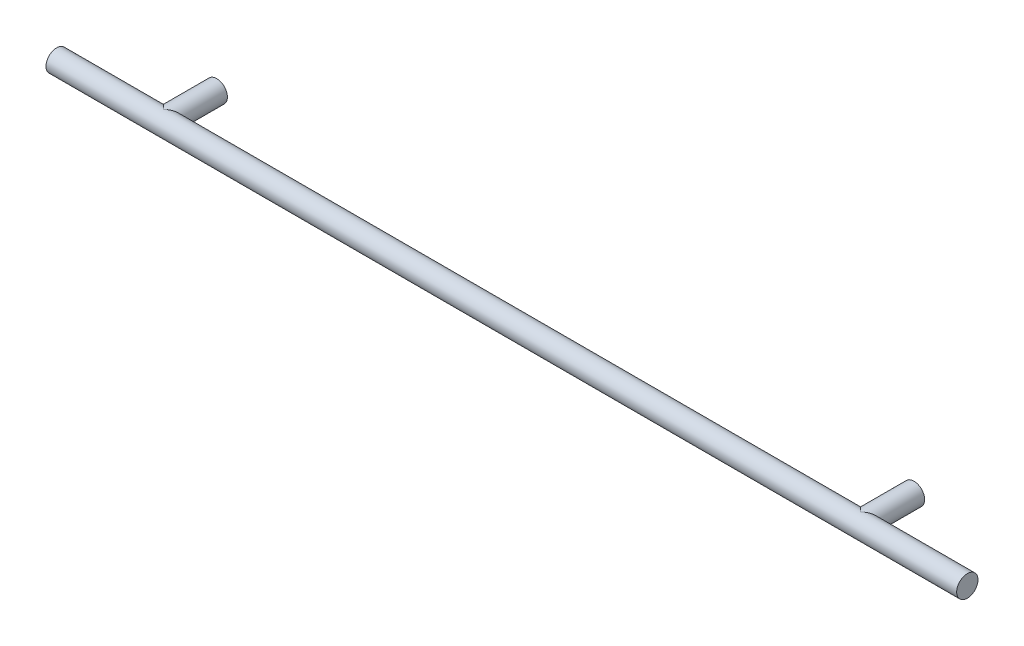
ISO-10303-21;
HEADER;
FILE_DESCRIPTION(('STEP AP214'),'2;1');
FILE_NAME('part.step','',(''),(''),'','','');
FILE_SCHEMA(('AUTOMOTIVE_DESIGN { 1 0 10303 214 1 1 1 1 }'));
ENDSEC;
DATA;
#1=APPLICATION_CONTEXT('core data for automotive mechanical design processes');
#2=APPLICATION_PROTOCOL_DEFINITION('international standard','automotive_design',2000,#1);
#3=PRODUCT_CONTEXT('',#1,'mechanical');
#4=PRODUCT('Part','Part','',(#3));
#5=PRODUCT_RELATED_PRODUCT_CATEGORY('part','',(#4));
#6=PRODUCT_DEFINITION_FORMATION('','',#4);
#7=PRODUCT_DEFINITION_CONTEXT('part definition',#1,'design');
#8=PRODUCT_DEFINITION('design','',#6,#7);
#9=PRODUCT_DEFINITION_SHAPE('','',#8);
#10=(LENGTH_UNIT() NAMED_UNIT(*) SI_UNIT(.MILLI.,.METRE.));
#11=(NAMED_UNIT(*) PLANE_ANGLE_UNIT() SI_UNIT($,.RADIAN.));
#12=(NAMED_UNIT(*) SI_UNIT($,.STERADIAN.) SOLID_ANGLE_UNIT());
#13=UNCERTAINTY_MEASURE_WITH_UNIT(LENGTH_MEASURE(1.E-05),#10,'distance_accuracy_value','');
#14=(GEOMETRIC_REPRESENTATION_CONTEXT(3) GLOBAL_UNCERTAINTY_ASSIGNED_CONTEXT((#13)) GLOBAL_UNIT_ASSIGNED_CONTEXT((#10,
#11,#12)) REPRESENTATION_CONTEXT('',''));
#15=CARTESIAN_POINT('',(0.,0.,0.));
#16=DIRECTION('',(0.,0.,1.));
#17=DIRECTION('',(1.,0.,0.));
#18=AXIS2_PLACEMENT_3D('',#15,#16,#17);
#19=CARTESIAN_POINT('',(203.2,0.,23.8125));
#20=DIRECTION('',(-1.,0.,0.));
#21=DIRECTION('',(0.,0.,1.));
#22=AXIS2_PLACEMENT_3D('',#19,#20,#21);
#23=CYLINDRICAL_SURFACE('',#22,4.7625);
#24=CARTESIAN_POINT('',(-155.575,0.,23.8125));
#25=DIRECTION('',(-0.707106781186547,0.,-0.707106781186547));
#26=DIRECTION('',(0.707106781186547,0.,-0.707106781186547));
#27=AXIS2_PLACEMENT_3D('',#24,#25,#26);
#28=ELLIPSE('',#27,6.73519209080187,4.76250000000001);
#29=CARTESIAN_POINT('',(-155.575,-4.76250000000001,23.8125));
#30=VERTEX_POINT('',#29);
#31=CARTESIAN_POINT('',(-155.575,4.76250000000001,23.8125));
#32=VERTEX_POINT('',#31);
#33=EDGE_CURVE('E79',#30,#32,#28,.F.);
#34=ORIENTED_EDGE('',*,*,#33,.T.);
#35=CARTESIAN_POINT('',(-155.575,0.,23.8125));
#36=DIRECTION('',(0.707106781186547,0.,-0.707106781186547));
#37=DIRECTION('',(-0.707106781186547,0.,-0.707106781186547));
#38=AXIS2_PLACEMENT_3D('',#35,#36,#37);
#39=ELLIPSE('',#38,6.73519209080187,4.76250000000001);
#40=EDGE_CURVE('E60',#32,#30,#39,.F.);
#41=ORIENTED_EDGE('',*,*,#40,.T.);
#42=EDGE_LOOP('',(#34,#41));
#43=FACE_BOUND('',#42,.T.);
#44=CARTESIAN_POINT('',(203.2,0.,23.8125));
#45=DIRECTION('',(1.,0.,0.));
#46=DIRECTION('',(0.,0.,-1.));
#47=AXIS2_PLACEMENT_3D('',#44,#45,#46);
#48=CIRCLE('',#47,4.7625);
#49=CARTESIAN_POINT('',(203.2,0.,19.05));
#50=VERTEX_POINT('',#49);
#51=EDGE_CURVE('E11',#50,#50,#48,.T.);
#52=ORIENTED_EDGE('',*,*,#51,.F.);
#53=EDGE_LOOP('',(#52));
#54=FACE_BOUND('',#53,.T.);
#55=CARTESIAN_POINT('',(-203.2,0.,23.8125));
#56=DIRECTION('',(1.,0.,0.));
#57=DIRECTION('',(0.,0.,-1.));
#58=AXIS2_PLACEMENT_3D('',#55,#56,#57);
#59=CIRCLE('',#58,4.7625);
#60=CARTESIAN_POINT('',(-203.2,0.,19.05));
#61=VERTEX_POINT('',#60);
#62=EDGE_CURVE('E42',#61,#61,#59,.T.);
#63=ORIENTED_EDGE('',*,*,#62,.T.);
#64=EDGE_LOOP('',(#63));
#65=FACE_BOUND('',#64,.T.);
#66=CARTESIAN_POINT('',(155.575,0.,23.8125));
#67=DIRECTION('',(-0.707106781186547,0.,-0.707106781186547));
#68=DIRECTION('',(0.707106781186547,0.,-0.707106781186547));
#69=AXIS2_PLACEMENT_3D('',#66,#67,#68);
#70=ELLIPSE('',#69,6.73519209080187,4.76250000000001);
#71=CARTESIAN_POINT('',(155.575,-4.76250000000001,23.8125));
#72=VERTEX_POINT('',#71);
#73=CARTESIAN_POINT('',(155.575,4.76250000000001,23.8125));
#74=VERTEX_POINT('',#73);
#75=EDGE_CURVE('E65',#72,#74,#70,.F.);
#76=ORIENTED_EDGE('',*,*,#75,.T.);
#77=CARTESIAN_POINT('',(155.575,0.,23.8125));
#78=DIRECTION('',(0.707106781186547,0.,-0.707106781186547));
#79=DIRECTION('',(-0.707106781186547,0.,-0.707106781186547));
#80=AXIS2_PLACEMENT_3D('',#77,#78,#79);
#81=ELLIPSE('',#80,6.73519209080187,4.76250000000001);
#82=EDGE_CURVE('E53',#74,#72,#81,.F.);
#83=ORIENTED_EDGE('',*,*,#82,.T.);
#84=EDGE_LOOP('',(#76,#83));
#85=FACE_BOUND('',#84,.T.);
#86=ADVANCED_FACE('F39',(#43,#54,#65,#85),#23,.T.);
#87=CARTESIAN_POINT('',(203.2,0.,23.8125));
#88=DIRECTION('',(1.,0.,0.));
#89=DIRECTION('',(0.,0.,-1.));
#90=AXIS2_PLACEMENT_3D('',#87,#88,#89);
#91=PLANE('',#90);
#92=ORIENTED_EDGE('',*,*,#51,.T.);
#93=EDGE_LOOP('',(#92));
#94=FACE_BOUND('',#93,.T.);
#95=ADVANCED_FACE('F102',(#94),#91,.T.);
#96=CARTESIAN_POINT('',(-203.2,0.,23.8125));
#97=DIRECTION('',(1.,0.,0.));
#98=DIRECTION('',(0.,0.,-1.));
#99=AXIS2_PLACEMENT_3D('',#96,#97,#98);
#100=PLANE('',#99);
#101=ORIENTED_EDGE('',*,*,#62,.F.);
#102=EDGE_LOOP('',(#101));
#103=FACE_BOUND('',#102,.T.);
#104=ADVANCED_FACE('F100',(#103),#100,.F.);
#105=CARTESIAN_POINT('',(-155.575,0.,0.));
#106=DIRECTION('',(0.,0.,1.));
#107=DIRECTION('',(1.,0.,0.));
#108=AXIS2_PLACEMENT_3D('',#105,#106,#107);
#109=PLANE('',#108);
#110=CARTESIAN_POINT('',(-155.575,0.,0.));
#111=DIRECTION('',(0.,0.,1.));
#112=DIRECTION('',(1.,0.,0.));
#113=AXIS2_PLACEMENT_3D('',#110,#111,#112);
#114=CIRCLE('',#113,4.76250000000001);
#115=CARTESIAN_POINT('',(-150.8125,0.,0.));
#116=VERTEX_POINT('',#115);
#117=EDGE_CURVE('E75',#116,#116,#114,.T.);
#118=ORIENTED_EDGE('',*,*,#117,.F.);
#119=EDGE_LOOP('',(#118));
#120=FACE_BOUND('',#119,.T.);
#121=ADVANCED_FACE('F97',(#120),#109,.F.);
#122=CARTESIAN_POINT('',(-155.575,0.,28.577));
#123=DIRECTION('',(0.,0.,-1.));
#124=DIRECTION('',(-1.,0.,0.));
#125=AXIS2_PLACEMENT_3D('',#122,#123,#124);
#126=CYLINDRICAL_SURFACE('',#125,4.76250000000001);
#127=ORIENTED_EDGE('',*,*,#117,.T.);
#128=EDGE_LOOP('',(#127));
#129=FACE_BOUND('',#128,.T.);
#130=ORIENTED_EDGE('',*,*,#33,.F.);
#131=ORIENTED_EDGE('',*,*,#40,.F.);
#132=EDGE_LOOP('',(#130,#131));
#133=FACE_BOUND('',#132,.T.);
#134=ADVANCED_FACE('F90',(#129,#133),#126,.T.);
#135=CARTESIAN_POINT('',(155.575,0.,0.));
#136=DIRECTION('',(0.,0.,-1.));
#137=DIRECTION('',(-1.,0.,0.));
#138=AXIS2_PLACEMENT_3D('',#135,#136,#137);
#139=PLANE('',#138);
#140=CARTESIAN_POINT('',(155.575,0.,0.));
#141=DIRECTION('',(0.,0.,1.));
#142=DIRECTION('',(-1.,0.,0.));
#143=AXIS2_PLACEMENT_3D('',#140,#141,#142);
#144=CIRCLE('',#143,4.76250000000001);
#145=CARTESIAN_POINT('',(150.8125,0.,0.));
#146=VERTEX_POINT('',#145);
#147=EDGE_CURVE('E68',#146,#146,#144,.T.);
#148=ORIENTED_EDGE('',*,*,#147,.F.);
#149=EDGE_LOOP('',(#148));
#150=FACE_BOUND('',#149,.T.);
#151=ADVANCED_FACE('F88',(#150),#139,.T.);
#152=CARTESIAN_POINT('',(155.575,0.,28.577));
#153=DIRECTION('',(0.,0.,-1.));
#154=DIRECTION('',(-1.,0.,0.));
#155=AXIS2_PLACEMENT_3D('',#152,#153,#154);
#156=CYLINDRICAL_SURFACE('',#155,4.76250000000001);
#157=ORIENTED_EDGE('',*,*,#147,.T.);
#158=EDGE_LOOP('',(#157));
#159=FACE_BOUND('',#158,.T.);
#160=ORIENTED_EDGE('',*,*,#75,.F.);
#161=ORIENTED_EDGE('',*,*,#82,.F.);
#162=EDGE_LOOP('',(#160,#161));
#163=FACE_BOUND('',#162,.T.);
#164=ADVANCED_FACE('F70',(#159,#163),#156,.T.);
#165=CLOSED_SHELL('',(#86,#95,#104,#121,#134,#151,#164));
#166=MANIFOLD_SOLID_BREP('B2',#165);
#167=ADVANCED_BREP_SHAPE_REPRESENTATION('',(#18,#166),#14);
#168=SHAPE_DEFINITION_REPRESENTATION(#9,#167);
ENDSEC;
END-ISO-10303-21;
